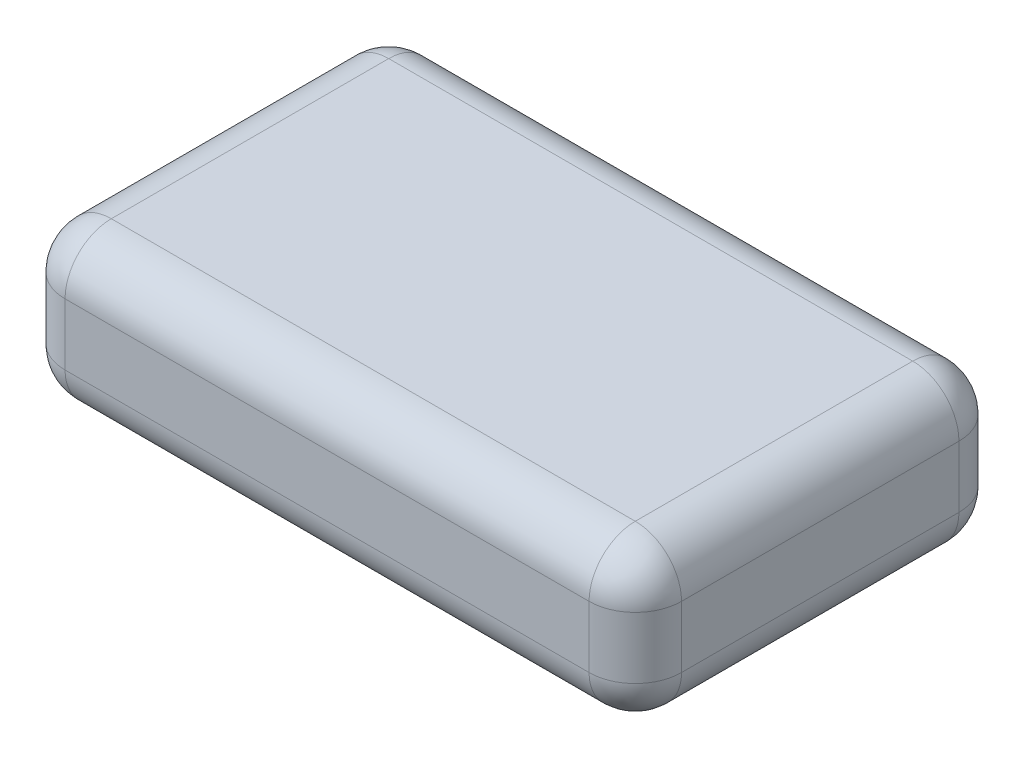
ISO-10303-21;
HEADER;
FILE_DESCRIPTION(('STEP AP214'),'2;1');
FILE_NAME('part.step','',(''),(''),'','','');
FILE_SCHEMA(('AUTOMOTIVE_DESIGN { 1 0 10303 214 1 1 1 1 }'));
ENDSEC;
DATA;
#1=APPLICATION_CONTEXT('core data for automotive mechanical design processes');
#2=APPLICATION_PROTOCOL_DEFINITION('international standard','automotive_design',2000,#1);
#3=PRODUCT_CONTEXT('',#1,'mechanical');
#4=PRODUCT('Part','Part','',(#3));
#5=PRODUCT_RELATED_PRODUCT_CATEGORY('part','',(#4));
#6=PRODUCT_DEFINITION_FORMATION('','',#4);
#7=PRODUCT_DEFINITION_CONTEXT('part definition',#1,'design');
#8=PRODUCT_DEFINITION('design','',#6,#7);
#9=PRODUCT_DEFINITION_SHAPE('','',#8);
#10=(LENGTH_UNIT() NAMED_UNIT(*) SI_UNIT(.MILLI.,.METRE.));
#11=(NAMED_UNIT(*) PLANE_ANGLE_UNIT() SI_UNIT($,.RADIAN.));
#12=(NAMED_UNIT(*) SI_UNIT($,.STERADIAN.) SOLID_ANGLE_UNIT());
#13=UNCERTAINTY_MEASURE_WITH_UNIT(LENGTH_MEASURE(1.E-05),#10,'distance_accuracy_value','');
#14=(GEOMETRIC_REPRESENTATION_CONTEXT(3) GLOBAL_UNCERTAINTY_ASSIGNED_CONTEXT((#13)) GLOBAL_UNIT_ASSIGNED_CONTEXT((#10,
#11,#12)) REPRESENTATION_CONTEXT('',''));
#15=CARTESIAN_POINT('',(0.,0.,0.));
#16=DIRECTION('',(0.,0.,1.));
#17=DIRECTION('',(1.,0.,0.));
#18=AXIS2_PLACEMENT_3D('',#15,#16,#17);
#19=CARTESIAN_POINT('',(127.,63.5,76.2));
#20=DIRECTION('',(-1.,0.,0.));
#21=DIRECTION('',(0.,0.,1.));
#22=AXIS2_PLACEMENT_3D('',#19,#20,#21);
#23=PLANE('',#22);
#24=DIRECTION('',(0.,0.,-1.));
#25=VECTOR('',#24,1.);
#26=CARTESIAN_POINT('',(127.,44.45,76.2));
#27=LINE('',#26,#25);
#28=CARTESIAN_POINT('',(127.,44.45,-57.15));
#29=VERTEX_POINT('',#28);
#30=CARTESIAN_POINT('',(127.,44.45,57.15));
#31=VERTEX_POINT('',#30);
#32=EDGE_CURVE('E197',#29,#31,#27,.F.);
#33=ORIENTED_EDGE('',*,*,#32,.T.);
#34=DIRECTION('',(0.,-1.,0.));
#35=VECTOR('',#34,1.);
#36=CARTESIAN_POINT('',(127.,63.5,57.15));
#37=LINE('',#36,#35);
#38=CARTESIAN_POINT('',(127.,19.05,57.15));
#39=VERTEX_POINT('',#38);
#40=EDGE_CURVE('E199',#31,#39,#37,.T.);
#41=ORIENTED_EDGE('',*,*,#40,.T.);
#42=DIRECTION('',(0.,0.,-1.));
#43=VECTOR('',#42,1.);
#44=CARTESIAN_POINT('',(127.,19.05,-76.2));
#45=LINE('',#44,#43);
#46=CARTESIAN_POINT('',(127.,19.05,-57.15));
#47=VERTEX_POINT('',#46);
#48=EDGE_CURVE('E193',#39,#47,#45,.T.);
#49=ORIENTED_EDGE('',*,*,#48,.T.);
#50=DIRECTION('',(0.,-1.,0.));
#51=VECTOR('',#50,1.);
#52=CARTESIAN_POINT('',(127.,63.5,-57.15));
#53=LINE('',#52,#51);
#54=EDGE_CURVE('E195',#47,#29,#53,.F.);
#55=ORIENTED_EDGE('',*,*,#54,.T.);
#56=EDGE_LOOP('',(#33,#41,#49,#55));
#57=FACE_BOUND('',#56,.T.);
#58=ADVANCED_FACE('F41',(#57),#23,.F.);
#59=CARTESIAN_POINT('',(-127.,63.5,-76.2));
#60=DIRECTION('',(0.,0.,1.));
#61=DIRECTION('',(1.,0.,0.));
#62=AXIS2_PLACEMENT_3D('',#59,#60,#61);
#63=PLANE('',#62);
#64=DIRECTION('',(-1.,0.,0.));
#65=VECTOR('',#64,1.);
#66=CARTESIAN_POINT('',(-127.,44.45,-76.2));
#67=LINE('',#66,#65);
#68=CARTESIAN_POINT('',(-107.95,44.45,-76.2));
#69=VERTEX_POINT('',#68);
#70=CARTESIAN_POINT('',(107.95,44.45,-76.2));
#71=VERTEX_POINT('',#70);
#72=EDGE_CURVE('E137',#69,#71,#67,.F.);
#73=ORIENTED_EDGE('',*,*,#72,.T.);
#74=DIRECTION('',(0.,-1.,0.));
#75=VECTOR('',#74,1.);
#76=CARTESIAN_POINT('',(107.95,63.5,-76.2));
#77=LINE('',#76,#75);
#78=CARTESIAN_POINT('',(107.95,19.05,-76.2));
#79=VERTEX_POINT('',#78);
#80=EDGE_CURVE('E173',#71,#79,#77,.T.);
#81=ORIENTED_EDGE('',*,*,#80,.T.);
#82=DIRECTION('',(-1.,0.,0.));
#83=VECTOR('',#82,1.);
#84=CARTESIAN_POINT('',(-127.,19.05,-76.2));
#85=LINE('',#84,#83);
#86=CARTESIAN_POINT('',(-107.95,19.05,-76.2));
#87=VERTEX_POINT('',#86);
#88=EDGE_CURVE('E170',#79,#87,#85,.T.);
#89=ORIENTED_EDGE('',*,*,#88,.T.);
#90=DIRECTION('',(0.,-1.,0.));
#91=VECTOR('',#90,1.);
#92=CARTESIAN_POINT('',(-107.95,63.5,-76.2));
#93=LINE('',#92,#91);
#94=EDGE_CURVE('E165',#87,#69,#93,.F.);
#95=ORIENTED_EDGE('',*,*,#94,.T.);
#96=EDGE_LOOP('',(#73,#81,#89,#95));
#97=FACE_BOUND('',#96,.T.);
#98=ADVANCED_FACE('F298',(#97),#63,.F.);
#99=CARTESIAN_POINT('',(-127.,63.5,76.2));
#100=DIRECTION('',(1.,0.,0.));
#101=DIRECTION('',(0.,0.,-1.));
#102=AXIS2_PLACEMENT_3D('',#99,#100,#101);
#103=PLANE('',#102);
#104=DIRECTION('',(0.,0.,1.));
#105=VECTOR('',#104,1.);
#106=CARTESIAN_POINT('',(-127.,44.45,76.2));
#107=LINE('',#106,#105);
#108=CARTESIAN_POINT('',(-127.,44.45,57.15));
#109=VERTEX_POINT('',#108);
#110=CARTESIAN_POINT('',(-127.,44.45,-57.15));
#111=VERTEX_POINT('',#110);
#112=EDGE_CURVE('E50',#109,#111,#107,.F.);
#113=ORIENTED_EDGE('',*,*,#112,.T.);
#114=DIRECTION('',(0.,-1.,0.));
#115=VECTOR('',#114,1.);
#116=CARTESIAN_POINT('',(-127.,63.5,-57.15));
#117=LINE('',#116,#115);
#118=CARTESIAN_POINT('',(-127.,19.05,-57.15));
#119=VERTEX_POINT('',#118);
#120=EDGE_CURVE('E11',#111,#119,#117,.T.);
#121=ORIENTED_EDGE('',*,*,#120,.T.);
#122=DIRECTION('',(0.,0.,1.));
#123=VECTOR('',#122,1.);
#124=CARTESIAN_POINT('',(-127.,19.05,76.2));
#125=LINE('',#124,#123);
#126=CARTESIAN_POINT('',(-127.,19.05,57.15));
#127=VERTEX_POINT('',#126);
#128=EDGE_CURVE('E202',#119,#127,#125,.T.);
#129=ORIENTED_EDGE('',*,*,#128,.T.);
#130=DIRECTION('',(0.,-1.,0.));
#131=VECTOR('',#130,1.);
#132=CARTESIAN_POINT('',(-127.,63.5,57.15));
#133=LINE('',#132,#131);
#134=EDGE_CURVE('E61',#127,#109,#133,.F.);
#135=ORIENTED_EDGE('',*,*,#134,.T.);
#136=EDGE_LOOP('',(#113,#121,#129,#135));
#137=FACE_BOUND('',#136,.T.);
#138=ADVANCED_FACE('F304',(#137),#103,.F.);
#139=CARTESIAN_POINT('',(-127.,63.5,76.2));
#140=DIRECTION('',(0.,0.,-1.));
#141=DIRECTION('',(-1.,0.,0.));
#142=AXIS2_PLACEMENT_3D('',#139,#140,#141);
#143=PLANE('',#142);
#144=DIRECTION('',(1.,0.,0.));
#145=VECTOR('',#144,1.);
#146=CARTESIAN_POINT('',(127.,19.05,76.2));
#147=LINE('',#146,#145);
#148=CARTESIAN_POINT('',(-107.95,19.05,76.2));
#149=VERTEX_POINT('',#148);
#150=CARTESIAN_POINT('',(107.95,19.05,76.2));
#151=VERTEX_POINT('',#150);
#152=EDGE_CURVE('E186',#149,#151,#147,.T.);
#153=ORIENTED_EDGE('',*,*,#152,.T.);
#154=DIRECTION('',(0.,-1.,0.));
#155=VECTOR('',#154,1.);
#156=CARTESIAN_POINT('',(107.95,63.5,76.2));
#157=LINE('',#156,#155);
#158=CARTESIAN_POINT('',(107.95,44.45,76.2));
#159=VERTEX_POINT('',#158);
#160=EDGE_CURVE('E191',#151,#159,#157,.F.);
#161=ORIENTED_EDGE('',*,*,#160,.T.);
#162=DIRECTION('',(1.,0.,0.));
#163=VECTOR('',#162,1.);
#164=CARTESIAN_POINT('',(-127.,44.45,76.2));
#165=LINE('',#164,#163);
#166=CARTESIAN_POINT('',(-107.95,44.45,76.2));
#167=VERTEX_POINT('',#166);
#168=EDGE_CURVE('E188',#159,#167,#165,.F.);
#169=ORIENTED_EDGE('',*,*,#168,.T.);
#170=DIRECTION('',(0.,-1.,0.));
#171=VECTOR('',#170,1.);
#172=CARTESIAN_POINT('',(-107.95,63.5,76.2));
#173=LINE('',#172,#171);
#174=EDGE_CURVE('E184',#167,#149,#173,.T.);
#175=ORIENTED_EDGE('',*,*,#174,.T.);
#176=EDGE_LOOP('',(#153,#161,#169,#175));
#177=FACE_BOUND('',#176,.T.);
#178=ADVANCED_FACE('F321',(#177),#143,.F.);
#179=CARTESIAN_POINT('',(0.,63.5,0.));
#180=DIRECTION('',(0.,-1.,0.));
#181=DIRECTION('',(0.,0.,-1.));
#182=AXIS2_PLACEMENT_3D('',#179,#180,#181);
#183=PLANE('',#182);
#184=DIRECTION('',(1.,0.,0.));
#185=VECTOR('',#184,1.);
#186=CARTESIAN_POINT('',(0.,63.5,57.15));
#187=LINE('',#186,#185);
#188=CARTESIAN_POINT('',(-107.95,63.5,57.15));
#189=VERTEX_POINT('',#188);
#190=CARTESIAN_POINT('',(107.95,63.5,57.15));
#191=VERTEX_POINT('',#190);
#192=EDGE_CURVE('E158',#189,#191,#187,.T.);
#193=ORIENTED_EDGE('',*,*,#192,.T.);
#194=DIRECTION('',(0.,0.,-1.));
#195=VECTOR('',#194,1.);
#196=CARTESIAN_POINT('',(107.95,63.5,0.));
#197=LINE('',#196,#195);
#198=CARTESIAN_POINT('',(107.95,63.5,-57.15));
#199=VERTEX_POINT('',#198);
#200=EDGE_CURVE('E162',#191,#199,#197,.T.);
#201=ORIENTED_EDGE('',*,*,#200,.T.);
#202=DIRECTION('',(-1.,0.,0.));
#203=VECTOR('',#202,1.);
#204=CARTESIAN_POINT('',(0.,63.5,-57.15));
#205=LINE('',#204,#203);
#206=CARTESIAN_POINT('',(-107.95,63.5,-57.15));
#207=VERTEX_POINT('',#206);
#208=EDGE_CURVE('E135',#199,#207,#205,.T.);
#209=ORIENTED_EDGE('',*,*,#208,.T.);
#210=DIRECTION('',(0.,0.,1.));
#211=VECTOR('',#210,1.);
#212=CARTESIAN_POINT('',(-107.95,63.5,0.));
#213=LINE('',#212,#211);
#214=EDGE_CURVE('E152',#207,#189,#213,.T.);
#215=ORIENTED_EDGE('',*,*,#214,.T.);
#216=EDGE_LOOP('',(#193,#201,#209,#215));
#217=FACE_BOUND('',#216,.T.);
#218=ADVANCED_FACE('F160',(#217),#183,.F.);
#219=CARTESIAN_POINT('',(0.,0.,0.));
#220=DIRECTION('',(0.,-1.,0.));
#221=DIRECTION('',(0.,0.,-1.));
#222=AXIS2_PLACEMENT_3D('',#219,#220,#221);
#223=PLANE('',#222);
#224=DIRECTION('',(-1.,0.,0.));
#225=VECTOR('',#224,1.);
#226=CARTESIAN_POINT('',(127.,0.,-57.15));
#227=LINE('',#226,#225);
#228=CARTESIAN_POINT('',(-107.95,0.,-57.15));
#229=VERTEX_POINT('',#228);
#230=CARTESIAN_POINT('',(107.95,0.,-57.15));
#231=VERTEX_POINT('',#230);
#232=EDGE_CURVE('E179',#229,#231,#227,.F.);
#233=ORIENTED_EDGE('',*,*,#232,.T.);
#234=DIRECTION('',(0.,0.,-1.));
#235=VECTOR('',#234,1.);
#236=CARTESIAN_POINT('',(107.95,0.,76.2));
#237=LINE('',#236,#235);
#238=CARTESIAN_POINT('',(107.95,0.,57.15));
#239=VERTEX_POINT('',#238);
#240=EDGE_CURVE('E182',#231,#239,#237,.F.);
#241=ORIENTED_EDGE('',*,*,#240,.T.);
#242=DIRECTION('',(1.,0.,0.));
#243=VECTOR('',#242,1.);
#244=CARTESIAN_POINT('',(-127.,0.,57.15));
#245=LINE('',#244,#243);
#246=CARTESIAN_POINT('',(-107.95,0.,57.15));
#247=VERTEX_POINT('',#246);
#248=EDGE_CURVE('E177',#239,#247,#245,.F.);
#249=ORIENTED_EDGE('',*,*,#248,.T.);
#250=DIRECTION('',(0.,0.,1.));
#251=VECTOR('',#250,1.);
#252=CARTESIAN_POINT('',(-107.95,0.,-76.2));
#253=LINE('',#252,#251);
#254=EDGE_CURVE('E175',#247,#229,#253,.F.);
#255=ORIENTED_EDGE('',*,*,#254,.T.);
#256=EDGE_LOOP('',(#233,#241,#249,#255));
#257=FACE_BOUND('',#256,.T.);
#258=ADVANCED_FACE('F323',(#257),#223,.T.);
#259=CARTESIAN_POINT('',(-127.,19.05,57.15));
#260=DIRECTION('',(-1.,0.,0.));
#261=DIRECTION('',(0.,0.,1.));
#262=AXIS2_PLACEMENT_3D('',#259,#260,#261);
#263=CYLINDRICAL_SURFACE('',#262,19.05);
#264=CARTESIAN_POINT('',(107.95,19.05,57.15));
#265=DIRECTION('',(1.,0.,0.));
#266=DIRECTION('',(0.,0.,-1.));
#267=AXIS2_PLACEMENT_3D('',#264,#265,#266);
#268=CIRCLE('',#267,19.05);
#269=EDGE_CURVE('E45',#151,#239,#268,.T.);
#270=ORIENTED_EDGE('',*,*,#269,.F.);
#271=ORIENTED_EDGE('',*,*,#152,.F.);
#272=CARTESIAN_POINT('',(-107.95,19.05,57.15));
#273=DIRECTION('',(-1.,0.,0.));
#274=DIRECTION('',(0.,0.,1.));
#275=AXIS2_PLACEMENT_3D('',#272,#273,#274);
#276=CIRCLE('',#275,19.05);
#277=EDGE_CURVE('E255',#247,#149,#276,.T.);
#278=ORIENTED_EDGE('',*,*,#277,.F.);
#279=ORIENTED_EDGE('',*,*,#248,.F.);
#280=EDGE_LOOP('',(#270,#271,#278,#279));
#281=FACE_BOUND('',#280,.T.);
#282=ADVANCED_FACE('F43',(#281),#263,.T.);
#283=CARTESIAN_POINT('',(107.95,19.05,57.15));
#284=DIRECTION('',(0.,-1.,0.));
#285=DIRECTION('',(0.,0.,-1.));
#286=AXIS2_PLACEMENT_3D('',#283,#284,#285);
#287=SPHERICAL_SURFACE('',#286,19.05);
#288=CARTESIAN_POINT('',(107.95,19.05,57.15));
#289=DIRECTION('',(0.,-1.,0.));
#290=DIRECTION('',(0.,0.,-1.));
#291=AXIS2_PLACEMENT_3D('',#288,#289,#290);
#292=CIRCLE('',#291,19.05);
#293=EDGE_CURVE('E250',#151,#39,#292,.F.);
#294=ORIENTED_EDGE('',*,*,#293,.F.);
#295=ORIENTED_EDGE('',*,*,#269,.T.);
#296=CARTESIAN_POINT('',(107.95,19.05,57.15));
#297=DIRECTION('',(0.,0.,1.));
#298=DIRECTION('',(1.,0.,0.));
#299=AXIS2_PLACEMENT_3D('',#296,#297,#298);
#300=CIRCLE('',#299,19.05);
#301=EDGE_CURVE('E253',#39,#239,#300,.F.);
#302=ORIENTED_EDGE('',*,*,#301,.F.);
#303=EDGE_LOOP('',(#294,#295,#302));
#304=FACE_BOUND('',#303,.T.);
#305=ADVANCED_FACE('F266',(#304),#287,.T.);
#306=CARTESIAN_POINT('',(-107.95,19.05,57.15));
#307=DIRECTION('',(0.,0.,1.));
#308=DIRECTION('',(0.,-1.,0.));
#309=AXIS2_PLACEMENT_3D('',#306,#307,#308);
#310=SPHERICAL_SURFACE('',#309,19.05);
#311=CARTESIAN_POINT('',(-107.95,19.05,57.15));
#312=DIRECTION('',(0.,0.,1.));
#313=DIRECTION('',(1.,0.,0.));
#314=AXIS2_PLACEMENT_3D('',#311,#312,#313);
#315=CIRCLE('',#314,19.05);
#316=EDGE_CURVE('E244',#247,#127,#315,.F.);
#317=ORIENTED_EDGE('',*,*,#316,.F.);
#318=ORIENTED_EDGE('',*,*,#277,.T.);
#319=CARTESIAN_POINT('',(-107.95,19.05,57.15));
#320=DIRECTION('',(0.,-1.,0.));
#321=DIRECTION('',(0.,0.,-1.));
#322=AXIS2_PLACEMENT_3D('',#319,#320,#321);
#323=CIRCLE('',#322,19.05);
#324=EDGE_CURVE('E247',#127,#149,#323,.F.);
#325=ORIENTED_EDGE('',*,*,#324,.F.);
#326=EDGE_LOOP('',(#317,#318,#325));
#327=FACE_BOUND('',#326,.T.);
#328=ADVANCED_FACE('F310',(#327),#310,.T.);
#329=CARTESIAN_POINT('',(107.95,19.05,76.2));
#330=DIRECTION('',(0.,0.,1.));
#331=DIRECTION('',(1.,0.,0.));
#332=AXIS2_PLACEMENT_3D('',#329,#330,#331);
#333=CYLINDRICAL_SURFACE('',#332,19.05);
#334=ORIENTED_EDGE('',*,*,#301,.T.);
#335=ORIENTED_EDGE('',*,*,#240,.F.);
#336=CARTESIAN_POINT('',(107.95,19.05,-57.15));
#337=DIRECTION('',(0.,0.,-1.));
#338=DIRECTION('',(-1.,0.,0.));
#339=AXIS2_PLACEMENT_3D('',#336,#337,#338);
#340=CIRCLE('',#339,19.05);
#341=EDGE_CURVE('E239',#47,#231,#340,.T.);
#342=ORIENTED_EDGE('',*,*,#341,.F.);
#343=ORIENTED_EDGE('',*,*,#48,.F.);
#344=EDGE_LOOP('',(#334,#335,#342,#343));
#345=FACE_BOUND('',#344,.T.);
#346=ADVANCED_FACE('F273',(#345),#333,.T.);
#347=CARTESIAN_POINT('',(107.95,63.5,57.15));
#348=DIRECTION('',(0.,-1.,0.));
#349=DIRECTION('',(0.,0.,-1.));
#350=AXIS2_PLACEMENT_3D('',#347,#348,#349);
#351=CYLINDRICAL_SURFACE('',#350,19.05);
#352=ORIENTED_EDGE('',*,*,#293,.T.);
#353=ORIENTED_EDGE('',*,*,#40,.F.);
#354=CARTESIAN_POINT('',(107.95,44.45,57.15));
#355=DIRECTION('',(0.,1.,0.));
#356=DIRECTION('',(0.,0.,1.));
#357=AXIS2_PLACEMENT_3D('',#354,#355,#356);
#358=CIRCLE('',#357,19.05);
#359=EDGE_CURVE('E236',#159,#31,#358,.T.);
#360=ORIENTED_EDGE('',*,*,#359,.F.);
#361=ORIENTED_EDGE('',*,*,#160,.F.);
#362=EDGE_LOOP('',(#352,#353,#360,#361));
#363=FACE_BOUND('',#362,.T.);
#364=ADVANCED_FACE('F282',(#363),#351,.T.);
#365=CARTESIAN_POINT('',(0.,44.45,57.15));
#366=DIRECTION('',(1.,0.,0.));
#367=DIRECTION('',(0.,0.,-1.));
#368=AXIS2_PLACEMENT_3D('',#365,#366,#367);
#369=CYLINDRICAL_SURFACE('',#368,19.05);
#370=CARTESIAN_POINT('',(-107.95,44.45,57.15));
#371=DIRECTION('',(-1.,0.,0.));
#372=DIRECTION('',(0.,0.,1.));
#373=AXIS2_PLACEMENT_3D('',#370,#371,#372);
#374=CIRCLE('',#373,19.05);
#375=EDGE_CURVE('E230',#167,#189,#374,.T.);
#376=ORIENTED_EDGE('',*,*,#375,.F.);
#377=ORIENTED_EDGE('',*,*,#168,.F.);
#378=CARTESIAN_POINT('',(107.95,44.45,57.15));
#379=DIRECTION('',(1.,0.,0.));
#380=DIRECTION('',(0.,0.,-1.));
#381=AXIS2_PLACEMENT_3D('',#378,#379,#380);
#382=CIRCLE('',#381,19.05);
#383=EDGE_CURVE('E233',#191,#159,#382,.T.);
#384=ORIENTED_EDGE('',*,*,#383,.F.);
#385=ORIENTED_EDGE('',*,*,#192,.F.);
#386=EDGE_LOOP('',(#376,#377,#384,#385));
#387=FACE_BOUND('',#386,.T.);
#388=ADVANCED_FACE('F319',(#387),#369,.T.);
#389=CARTESIAN_POINT('',(-107.95,63.5,57.15));
#390=DIRECTION('',(0.,-1.,0.));
#391=DIRECTION('',(0.,0.,-1.));
#392=AXIS2_PLACEMENT_3D('',#389,#390,#391);
#393=CYLINDRICAL_SURFACE('',#392,19.05);
#394=ORIENTED_EDGE('',*,*,#324,.T.);
#395=ORIENTED_EDGE('',*,*,#174,.F.);
#396=CARTESIAN_POINT('',(-107.95,44.45,57.15));
#397=DIRECTION('',(0.,1.,0.));
#398=DIRECTION('',(0.,0.,1.));
#399=AXIS2_PLACEMENT_3D('',#396,#397,#398);
#400=CIRCLE('',#399,19.05);
#401=EDGE_CURVE('E228',#109,#167,#400,.T.);
#402=ORIENTED_EDGE('',*,*,#401,.F.);
#403=ORIENTED_EDGE('',*,*,#134,.F.);
#404=EDGE_LOOP('',(#394,#395,#402,#403));
#405=FACE_BOUND('',#404,.T.);
#406=ADVANCED_FACE('F313',(#405),#393,.T.);
#407=CARTESIAN_POINT('',(-107.95,19.05,76.2));
#408=DIRECTION('',(0.,0.,-1.));
#409=DIRECTION('',(-1.,0.,0.));
#410=AXIS2_PLACEMENT_3D('',#407,#408,#409);
#411=CYLINDRICAL_SURFACE('',#410,19.05);
#412=ORIENTED_EDGE('',*,*,#316,.T.);
#413=ORIENTED_EDGE('',*,*,#128,.F.);
#414=CARTESIAN_POINT('',(-107.95,19.05,-57.15));
#415=DIRECTION('',(0.,0.,-1.));
#416=DIRECTION('',(-1.,0.,0.));
#417=AXIS2_PLACEMENT_3D('',#414,#415,#416);
#418=CIRCLE('',#417,19.05);
#419=EDGE_CURVE('E225',#229,#119,#418,.T.);
#420=ORIENTED_EDGE('',*,*,#419,.F.);
#421=ORIENTED_EDGE('',*,*,#254,.F.);
#422=EDGE_LOOP('',(#412,#413,#420,#421));
#423=FACE_BOUND('',#422,.T.);
#424=ADVANCED_FACE('F309',(#423),#411,.T.);
#425=CARTESIAN_POINT('',(-127.,19.05,-57.15));
#426=DIRECTION('',(1.,0.,0.));
#427=DIRECTION('',(0.,0.,-1.));
#428=AXIS2_PLACEMENT_3D('',#425,#426,#427);
#429=CYLINDRICAL_SURFACE('',#428,19.05);
#430=CARTESIAN_POINT('',(107.95,19.05,-57.15));
#431=DIRECTION('',(1.,0.,0.));
#432=DIRECTION('',(0.,0.,-1.));
#433=AXIS2_PLACEMENT_3D('',#430,#431,#432);
#434=CIRCLE('',#433,19.05);
#435=EDGE_CURVE('E241',#231,#79,#434,.T.);
#436=ORIENTED_EDGE('',*,*,#435,.F.);
#437=ORIENTED_EDGE('',*,*,#232,.F.);
#438=CARTESIAN_POINT('',(-107.95,19.05,-57.15));
#439=DIRECTION('',(-1.,0.,0.));
#440=DIRECTION('',(0.,0.,1.));
#441=AXIS2_PLACEMENT_3D('',#438,#439,#440);
#442=CIRCLE('',#441,19.05);
#443=EDGE_CURVE('E222',#87,#229,#442,.T.);
#444=ORIENTED_EDGE('',*,*,#443,.F.);
#445=ORIENTED_EDGE('',*,*,#88,.F.);
#446=EDGE_LOOP('',(#436,#437,#444,#445));
#447=FACE_BOUND('',#446,.T.);
#448=ADVANCED_FACE('F327',(#447),#429,.T.);
#449=CARTESIAN_POINT('',(107.95,19.05,-57.15));
#450=DIRECTION('',(0.,-1.,0.));
#451=DIRECTION('',(0.,0.,-1.));
#452=AXIS2_PLACEMENT_3D('',#449,#450,#451);
#453=SPHERICAL_SURFACE('',#452,19.05);
#454=ORIENTED_EDGE('',*,*,#341,.T.);
#455=ORIENTED_EDGE('',*,*,#435,.T.);
#456=CARTESIAN_POINT('',(107.95,19.05,-57.15));
#457=DIRECTION('',(0.,-1.,0.));
#458=DIRECTION('',(0.,0.,-1.));
#459=AXIS2_PLACEMENT_3D('',#456,#457,#458);
#460=CIRCLE('',#459,19.05);
#461=EDGE_CURVE('E219',#47,#79,#460,.F.);
#462=ORIENTED_EDGE('',*,*,#461,.F.);
#463=EDGE_LOOP('',(#454,#455,#462));
#464=FACE_BOUND('',#463,.T.);
#465=ADVANCED_FACE('F433',(#464),#453,.T.);
#466=CARTESIAN_POINT('',(107.95,44.45,57.15));
#467=DIRECTION('',(0.,0.,1.));
#468=DIRECTION('',(1.,0.,0.));
#469=AXIS2_PLACEMENT_3D('',#466,#467,#468);
#470=SPHERICAL_SURFACE('',#469,19.05);
#471=ORIENTED_EDGE('',*,*,#383,.T.);
#472=ORIENTED_EDGE('',*,*,#359,.T.);
#473=CARTESIAN_POINT('',(107.95,44.45,57.15));
#474=DIRECTION('',(0.,0.,1.));
#475=DIRECTION('',(1.,0.,0.));
#476=AXIS2_PLACEMENT_3D('',#473,#474,#475);
#477=CIRCLE('',#476,19.05);
#478=EDGE_CURVE('E216',#191,#31,#477,.F.);
#479=ORIENTED_EDGE('',*,*,#478,.F.);
#480=EDGE_LOOP('',(#471,#472,#479));
#481=FACE_BOUND('',#480,.T.);
#482=ADVANCED_FACE('F285',(#481),#470,.T.);
#483=CARTESIAN_POINT('',(-107.95,44.45,57.15));
#484=DIRECTION('',(0.,0.,1.));
#485=DIRECTION('',(1.,0.,0.));
#486=AXIS2_PLACEMENT_3D('',#483,#484,#485);
#487=SPHERICAL_SURFACE('',#486,19.05);
#488=ORIENTED_EDGE('',*,*,#401,.T.);
#489=ORIENTED_EDGE('',*,*,#375,.T.);
#490=CARTESIAN_POINT('',(-107.95,44.45,57.15));
#491=DIRECTION('',(0.,0.,1.));
#492=DIRECTION('',(1.,0.,0.));
#493=AXIS2_PLACEMENT_3D('',#490,#491,#492);
#494=CIRCLE('',#493,19.05);
#495=EDGE_CURVE('E155',#109,#189,#494,.F.);
#496=ORIENTED_EDGE('',*,*,#495,.F.);
#497=EDGE_LOOP('',(#488,#489,#496));
#498=FACE_BOUND('',#497,.T.);
#499=ADVANCED_FACE('F316',(#498),#487,.T.);
#500=CARTESIAN_POINT('',(-107.95,19.05,-57.15));
#501=DIRECTION('',(0.,-1.,0.));
#502=DIRECTION('',(0.,0.,-1.));
#503=AXIS2_PLACEMENT_3D('',#500,#501,#502);
#504=SPHERICAL_SURFACE('',#503,19.05);
#505=ORIENTED_EDGE('',*,*,#443,.T.);
#506=ORIENTED_EDGE('',*,*,#419,.T.);
#507=CARTESIAN_POINT('',(-107.95,19.05,-57.15));
#508=DIRECTION('',(0.,-1.,0.));
#509=DIRECTION('',(0.,0.,-1.));
#510=AXIS2_PLACEMENT_3D('',#507,#508,#509);
#511=CIRCLE('',#510,19.05);
#512=EDGE_CURVE('E213',#87,#119,#511,.F.);
#513=ORIENTED_EDGE('',*,*,#512,.F.);
#514=EDGE_LOOP('',(#505,#506,#513));
#515=FACE_BOUND('',#514,.T.);
#516=ADVANCED_FACE('F329',(#515),#504,.T.);
#517=CARTESIAN_POINT('',(107.95,63.5,-57.15));
#518=DIRECTION('',(0.,-1.,0.));
#519=DIRECTION('',(0.,0.,-1.));
#520=AXIS2_PLACEMENT_3D('',#517,#518,#519);
#521=CYLINDRICAL_SURFACE('',#520,19.05);
#522=ORIENTED_EDGE('',*,*,#461,.T.);
#523=ORIENTED_EDGE('',*,*,#80,.F.);
#524=CARTESIAN_POINT('',(107.95,44.45,-57.15));
#525=DIRECTION('',(0.,1.,0.));
#526=DIRECTION('',(0.,0.,1.));
#527=AXIS2_PLACEMENT_3D('',#524,#525,#526);
#528=CIRCLE('',#527,19.05);
#529=EDGE_CURVE('E210',#29,#71,#528,.T.);
#530=ORIENTED_EDGE('',*,*,#529,.F.);
#531=ORIENTED_EDGE('',*,*,#54,.F.);
#532=EDGE_LOOP('',(#522,#523,#530,#531));
#533=FACE_BOUND('',#532,.T.);
#534=ADVANCED_FACE('F295',(#533),#521,.T.);
#535=CARTESIAN_POINT('',(107.95,44.45,0.));
#536=DIRECTION('',(0.,0.,-1.));
#537=DIRECTION('',(-1.,0.,0.));
#538=AXIS2_PLACEMENT_3D('',#535,#536,#537);
#539=CYLINDRICAL_SURFACE('',#538,19.05);
#540=ORIENTED_EDGE('',*,*,#478,.T.);
#541=ORIENTED_EDGE('',*,*,#32,.F.);
#542=CARTESIAN_POINT('',(107.95,44.45,-57.15));
#543=DIRECTION('',(0.,0.,-1.));
#544=DIRECTION('',(-1.,0.,0.));
#545=AXIS2_PLACEMENT_3D('',#542,#543,#544);
#546=CIRCLE('',#545,19.05);
#547=EDGE_CURVE('E149',#199,#29,#546,.T.);
#548=ORIENTED_EDGE('',*,*,#547,.F.);
#549=ORIENTED_EDGE('',*,*,#200,.F.);
#550=EDGE_LOOP('',(#540,#541,#548,#549));
#551=FACE_BOUND('',#550,.T.);
#552=ADVANCED_FACE('F288',(#551),#539,.T.);
#553=CARTESIAN_POINT('',(-107.95,44.45,0.));
#554=DIRECTION('',(0.,0.,1.));
#555=DIRECTION('',(1.,0.,0.));
#556=AXIS2_PLACEMENT_3D('',#553,#554,#555);
#557=CYLINDRICAL_SURFACE('',#556,19.05);
#558=ORIENTED_EDGE('',*,*,#495,.T.);
#559=ORIENTED_EDGE('',*,*,#214,.F.);
#560=CARTESIAN_POINT('',(-107.95,44.45,-57.15));
#561=DIRECTION('',(0.,0.,-1.));
#562=DIRECTION('',(0.,1.,0.));
#563=AXIS2_PLACEMENT_3D('',#560,#561,#562);
#564=CIRCLE('',#563,19.05);
#565=EDGE_CURVE('E143',#111,#207,#564,.T.);
#566=ORIENTED_EDGE('',*,*,#565,.F.);
#567=ORIENTED_EDGE('',*,*,#112,.F.);
#568=EDGE_LOOP('',(#558,#559,#566,#567));
#569=FACE_BOUND('',#568,.T.);
#570=ADVANCED_FACE('F153',(#569),#557,.T.);
#571=CARTESIAN_POINT('',(-107.95,63.5,-57.15));
#572=DIRECTION('',(0.,-1.,0.));
#573=DIRECTION('',(0.,0.,-1.));
#574=AXIS2_PLACEMENT_3D('',#571,#572,#573);
#575=CYLINDRICAL_SURFACE('',#574,19.05);
#576=ORIENTED_EDGE('',*,*,#512,.T.);
#577=ORIENTED_EDGE('',*,*,#120,.F.);
#578=CARTESIAN_POINT('',(-107.95,44.45,-57.15));
#579=DIRECTION('',(0.,1.,0.));
#580=DIRECTION('',(0.,0.,1.));
#581=AXIS2_PLACEMENT_3D('',#578,#579,#580);
#582=CIRCLE('',#581,19.05);
#583=EDGE_CURVE('E147',#69,#111,#582,.T.);
#584=ORIENTED_EDGE('',*,*,#583,.F.);
#585=ORIENTED_EDGE('',*,*,#94,.F.);
#586=EDGE_LOOP('',(#576,#577,#584,#585));
#587=FACE_BOUND('',#586,.T.);
#588=ADVANCED_FACE('F302',(#587),#575,.T.);
#589=CARTESIAN_POINT('',(107.95,44.45,-57.15));
#590=DIRECTION('',(1.,0.,0.));
#591=DIRECTION('',(0.,0.,-1.));
#592=AXIS2_PLACEMENT_3D('',#589,#590,#591);
#593=SPHERICAL_SURFACE('',#592,19.05);
#594=ORIENTED_EDGE('',*,*,#547,.T.);
#595=ORIENTED_EDGE('',*,*,#529,.T.);
#596=CARTESIAN_POINT('',(107.95,44.45,-57.15));
#597=DIRECTION('',(1.,0.,0.));
#598=DIRECTION('',(0.,1.,0.));
#599=AXIS2_PLACEMENT_3D('',#596,#597,#598);
#600=CIRCLE('',#599,19.05);
#601=EDGE_CURVE('E140',#199,#71,#600,.F.);
#602=ORIENTED_EDGE('',*,*,#601,.F.);
#603=EDGE_LOOP('',(#594,#595,#602));
#604=FACE_BOUND('',#603,.T.);
#605=ADVANCED_FACE('F292',(#604),#593,.T.);
#606=CARTESIAN_POINT('',(-107.95,44.45,-57.15));
#607=DIRECTION('',(-1.,0.,0.));
#608=DIRECTION('',(0.,0.,1.));
#609=AXIS2_PLACEMENT_3D('',#606,#607,#608);
#610=SPHERICAL_SURFACE('',#609,19.05);
#611=ORIENTED_EDGE('',*,*,#583,.T.);
#612=ORIENTED_EDGE('',*,*,#565,.T.);
#613=CARTESIAN_POINT('',(-107.95,44.45,-57.15));
#614=DIRECTION('',(-1.,0.,0.));
#615=DIRECTION('',(0.,0.,1.));
#616=AXIS2_PLACEMENT_3D('',#613,#614,#615);
#617=CIRCLE('',#616,19.05);
#618=EDGE_CURVE('E131',#69,#207,#617,.F.);
#619=ORIENTED_EDGE('',*,*,#618,.F.);
#620=EDGE_LOOP('',(#611,#612,#619));
#621=FACE_BOUND('',#620,.T.);
#622=ADVANCED_FACE('F145',(#621),#610,.T.);
#623=CARTESIAN_POINT('',(0.,44.45,-57.15));
#624=DIRECTION('',(-1.,0.,0.));
#625=DIRECTION('',(0.,0.,1.));
#626=AXIS2_PLACEMENT_3D('',#623,#624,#625);
#627=CYLINDRICAL_SURFACE('',#626,19.05);
#628=ORIENTED_EDGE('',*,*,#601,.T.);
#629=ORIENTED_EDGE('',*,*,#72,.F.);
#630=ORIENTED_EDGE('',*,*,#618,.T.);
#631=ORIENTED_EDGE('',*,*,#208,.F.);
#632=EDGE_LOOP('',(#628,#629,#630,#631));
#633=FACE_BOUND('',#632,.T.);
#634=ADVANCED_FACE('F133',(#633),#627,.T.);
#635=CLOSED_SHELL('',(#58,#98,#138,#178,#218,#258,#282,#305,#328,#346,#364,#388,#406,#424,#448,
#465,#482,#499,#516,#534,#552,#570,#588,#605,#622,#634));
#636=MANIFOLD_SOLID_BREP('B2',#635);
#637=ADVANCED_BREP_SHAPE_REPRESENTATION('',(#18,#636),#14);
#638=SHAPE_DEFINITION_REPRESENTATION(#9,#637);
ENDSEC;
END-ISO-10303-21;
